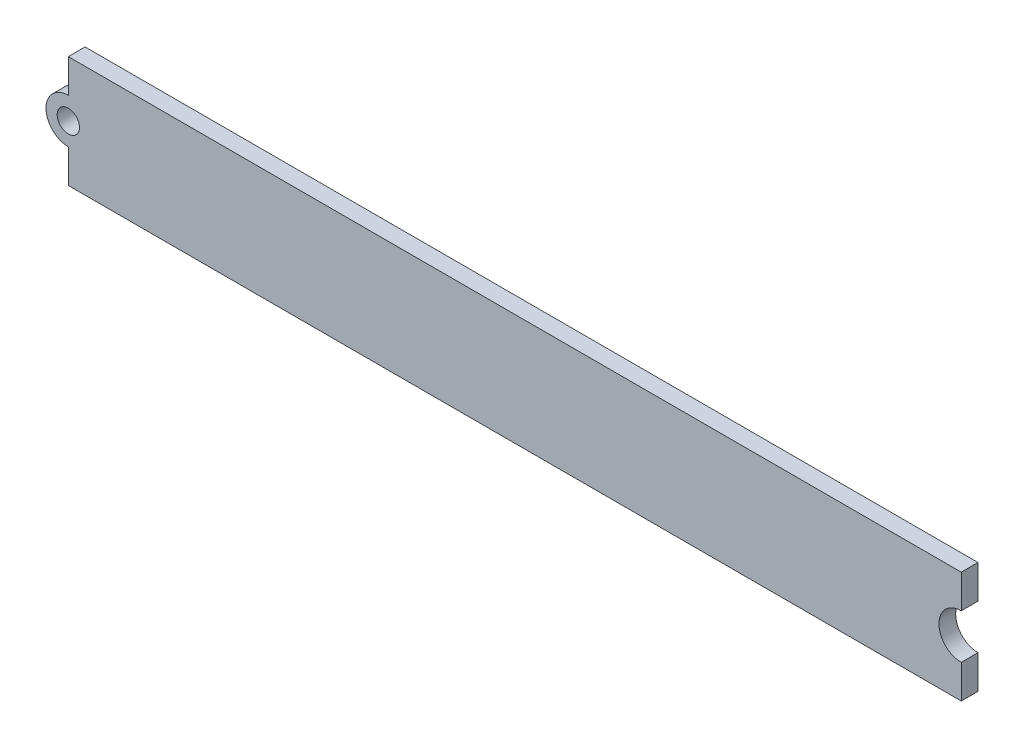
ISO-10303-21;
HEADER;
FILE_DESCRIPTION(('STEP AP214'),'2;1');
FILE_NAME('part.step','',(''),(''),'','','');
FILE_SCHEMA(('AUTOMOTIVE_DESIGN { 1 0 10303 214 1 1 1 1 }'));
ENDSEC;
DATA;
#1=APPLICATION_CONTEXT('core data for automotive mechanical design processes');
#2=APPLICATION_PROTOCOL_DEFINITION('international standard','automotive_design',2000,#1);
#3=PRODUCT_CONTEXT('',#1,'mechanical');
#4=PRODUCT('Part','Part','',(#3));
#5=PRODUCT_RELATED_PRODUCT_CATEGORY('part','',(#4));
#6=PRODUCT_DEFINITION_FORMATION('','',#4);
#7=PRODUCT_DEFINITION_CONTEXT('part definition',#1,'design');
#8=PRODUCT_DEFINITION('design','',#6,#7);
#9=PRODUCT_DEFINITION_SHAPE('','',#8);
#10=(LENGTH_UNIT() NAMED_UNIT(*) SI_UNIT(.MILLI.,.METRE.));
#11=(NAMED_UNIT(*) PLANE_ANGLE_UNIT() SI_UNIT($,.RADIAN.));
#12=(NAMED_UNIT(*) SI_UNIT($,.STERADIAN.) SOLID_ANGLE_UNIT());
#13=UNCERTAINTY_MEASURE_WITH_UNIT(LENGTH_MEASURE(1.E-05),#10,'distance_accuracy_value','');
#14=(GEOMETRIC_REPRESENTATION_CONTEXT(3) GLOBAL_UNCERTAINTY_ASSIGNED_CONTEXT((#13)) GLOBAL_UNIT_ASSIGNED_CONTEXT((#10,
#11,#12)) REPRESENTATION_CONTEXT('',''));
#15=CARTESIAN_POINT('',(0.,0.,0.));
#16=DIRECTION('',(0.,0.,1.));
#17=DIRECTION('',(1.,0.,0.));
#18=AXIS2_PLACEMENT_3D('',#15,#16,#17);
#19=CARTESIAN_POINT('',(-40.,0.,1.5));
#20=DIRECTION('',(0.,0.,1.));
#21=DIRECTION('',(1.,0.,0.));
#22=AXIS2_PLACEMENT_3D('',#19,#20,#21);
#23=PLANE('',#22);
#24=DIRECTION('',(0.,-1.,0.));
#25=VECTOR('',#24,1.);
#26=CARTESIAN_POINT('',(-40.,5.,1.5));
#27=LINE('',#26,#25);
#28=CARTESIAN_POINT('',(-40.,5.,1.5));
#29=VERTEX_POINT('',#28);
#30=CARTESIAN_POINT('',(-40.,2.,1.5));
#31=VERTEX_POINT('',#30);
#32=EDGE_CURVE('E151',#29,#31,#27,.T.);
#33=ORIENTED_EDGE('',*,*,#32,.T.);
#34=CARTESIAN_POINT('',(-40.,0.,1.5));
#35=DIRECTION('',(0.,0.,1.));
#36=DIRECTION('',(1.,0.,0.));
#37=AXIS2_PLACEMENT_3D('',#34,#35,#36);
#38=CIRCLE('',#37,2.);
#39=CARTESIAN_POINT('',(-40.,-2.,1.5));
#40=VERTEX_POINT('',#39);
#41=EDGE_CURVE('E99',#31,#40,#38,.T.);
#42=ORIENTED_EDGE('',*,*,#41,.T.);
#43=DIRECTION('',(0.,-1.,0.));
#44=VECTOR('',#43,1.);
#45=CARTESIAN_POINT('',(-40.,-2.,1.5));
#46=LINE('',#45,#44);
#47=CARTESIAN_POINT('',(-40.,-5.,1.5));
#48=VERTEX_POINT('',#47);
#49=EDGE_CURVE('E166',#40,#48,#46,.T.);
#50=ORIENTED_EDGE('',*,*,#49,.T.);
#51=DIRECTION('',(1.,0.,0.));
#52=VECTOR('',#51,1.);
#53=CARTESIAN_POINT('',(-40.,-5.,1.5));
#54=LINE('',#53,#52);
#55=CARTESIAN_POINT('',(40.,-4.99999999999999,1.5));
#56=VERTEX_POINT('',#55);
#57=EDGE_CURVE('E179',#48,#56,#54,.T.);
#58=ORIENTED_EDGE('',*,*,#57,.T.);
#59=DIRECTION('',(0.,1.,0.));
#60=VECTOR('',#59,1.);
#61=CARTESIAN_POINT('',(40.,-1.99999999999999,1.5));
#62=LINE('',#61,#60);
#63=CARTESIAN_POINT('',(40.,-1.99999999999999,1.5));
#64=VERTEX_POINT('',#63);
#65=EDGE_CURVE('E118',#56,#64,#62,.T.);
#66=ORIENTED_EDGE('',*,*,#65,.T.);
#67=CARTESIAN_POINT('',(40.,0.,1.5));
#68=DIRECTION('',(0.,0.,-1.));
#69=DIRECTION('',(1.,0.,0.));
#70=AXIS2_PLACEMENT_3D('',#67,#68,#69);
#71=CIRCLE('',#70,2.);
#72=CARTESIAN_POINT('',(40.,2.00000000000001,1.5));
#73=VERTEX_POINT('',#72);
#74=EDGE_CURVE('E112',#64,#73,#71,.T.);
#75=ORIENTED_EDGE('',*,*,#74,.T.);
#76=DIRECTION('',(0.,1.,0.));
#77=VECTOR('',#76,1.);
#78=CARTESIAN_POINT('',(40.,5.00000000000001,1.5));
#79=LINE('',#78,#77);
#80=CARTESIAN_POINT('',(40.,5.00000000000001,1.5));
#81=VERTEX_POINT('',#80);
#82=EDGE_CURVE('E116',#73,#81,#79,.T.);
#83=ORIENTED_EDGE('',*,*,#82,.T.);
#84=DIRECTION('',(-1.,0.,0.));
#85=VECTOR('',#84,1.);
#86=CARTESIAN_POINT('',(-40.,5.,1.5));
#87=LINE('',#86,#85);
#88=EDGE_CURVE('E56',#81,#29,#87,.T.);
#89=ORIENTED_EDGE('',*,*,#88,.T.);
#90=EDGE_LOOP('',(#33,#42,#50,#58,#66,#75,#83,#89));
#91=FACE_BOUND('',#90,.T.);
#92=CARTESIAN_POINT('',(-40.,0.,1.5));
#93=DIRECTION('',(0.,0.,1.));
#94=DIRECTION('',(1.,0.,0.));
#95=AXIS2_PLACEMENT_3D('',#92,#93,#94);
#96=CIRCLE('',#95,0.999999999999998);
#97=CARTESIAN_POINT('',(-39.,0.,1.5));
#98=VERTEX_POINT('',#97);
#99=EDGE_CURVE('E140',#98,#98,#96,.T.);
#100=ORIENTED_EDGE('',*,*,#99,.F.);
#101=EDGE_LOOP('',(#100));
#102=FACE_BOUND('',#101,.T.);
#103=ADVANCED_FACE('F39',(#91,#102),#23,.T.);
#104=CARTESIAN_POINT('',(-40.,0.,0.));
#105=DIRECTION('',(0.,0.,1.));
#106=DIRECTION('',(1.,0.,0.));
#107=AXIS2_PLACEMENT_3D('',#104,#105,#106);
#108=PLANE('',#107);
#109=DIRECTION('',(0.,-1.,0.));
#110=VECTOR('',#109,1.);
#111=CARTESIAN_POINT('',(-40.,5.,0.));
#112=LINE('',#111,#110);
#113=CARTESIAN_POINT('',(-40.,5.,0.));
#114=VERTEX_POINT('',#113);
#115=CARTESIAN_POINT('',(-40.,2.,0.));
#116=VERTEX_POINT('',#115);
#117=EDGE_CURVE('E136',#114,#116,#112,.T.);
#118=ORIENTED_EDGE('',*,*,#117,.F.);
#119=DIRECTION('',(-1.,0.,0.));
#120=VECTOR('',#119,1.);
#121=CARTESIAN_POINT('',(-40.,5.,0.));
#122=LINE('',#121,#120);
#123=CARTESIAN_POINT('',(40.,5.00000000000001,0.));
#124=VERTEX_POINT('',#123);
#125=EDGE_CURVE('E91',#124,#114,#122,.T.);
#126=ORIENTED_EDGE('',*,*,#125,.F.);
#127=DIRECTION('',(0.,1.,0.));
#128=VECTOR('',#127,1.);
#129=CARTESIAN_POINT('',(40.,5.00000000000001,0.));
#130=LINE('',#129,#128);
#131=CARTESIAN_POINT('',(40.,2.00000000000001,0.));
#132=VERTEX_POINT('',#131);
#133=EDGE_CURVE('E85',#132,#124,#130,.T.);
#134=ORIENTED_EDGE('',*,*,#133,.F.);
#135=CARTESIAN_POINT('',(40.,0.,0.));
#136=DIRECTION('',(0.,0.,-1.));
#137=DIRECTION('',(1.,0.,0.));
#138=AXIS2_PLACEMENT_3D('',#135,#136,#137);
#139=CIRCLE('',#138,2.);
#140=CARTESIAN_POINT('',(40.,-1.99999999999999,0.));
#141=VERTEX_POINT('',#140);
#142=EDGE_CURVE('E126',#141,#132,#139,.T.);
#143=ORIENTED_EDGE('',*,*,#142,.F.);
#144=DIRECTION('',(0.,1.,0.));
#145=VECTOR('',#144,1.);
#146=CARTESIAN_POINT('',(40.,-1.99999999999999,0.));
#147=LINE('',#146,#145);
#148=CARTESIAN_POINT('',(40.,-4.99999999999999,0.));
#149=VERTEX_POINT('',#148);
#150=EDGE_CURVE('E146',#149,#141,#147,.T.);
#151=ORIENTED_EDGE('',*,*,#150,.F.);
#152=DIRECTION('',(1.,0.,0.));
#153=VECTOR('',#152,1.);
#154=CARTESIAN_POINT('',(-40.,-5.,0.));
#155=LINE('',#154,#153);
#156=CARTESIAN_POINT('',(-40.,-5.,0.));
#157=VERTEX_POINT('',#156);
#158=EDGE_CURVE('E144',#157,#149,#155,.T.);
#159=ORIENTED_EDGE('',*,*,#158,.F.);
#160=DIRECTION('',(0.,-1.,0.));
#161=VECTOR('',#160,1.);
#162=CARTESIAN_POINT('',(-40.,-2.,0.));
#163=LINE('',#162,#161);
#164=CARTESIAN_POINT('',(-40.,-2.,0.));
#165=VERTEX_POINT('',#164);
#166=EDGE_CURVE('E142',#165,#157,#163,.T.);
#167=ORIENTED_EDGE('',*,*,#166,.F.);
#168=CARTESIAN_POINT('',(-40.,0.,0.));
#169=DIRECTION('',(0.,0.,1.));
#170=DIRECTION('',(1.,0.,0.));
#171=AXIS2_PLACEMENT_3D('',#168,#169,#170);
#172=CIRCLE('',#171,2.);
#173=EDGE_CURVE('E139',#116,#165,#172,.T.);
#174=ORIENTED_EDGE('',*,*,#173,.F.);
#175=EDGE_LOOP('',(#118,#126,#134,#143,#151,#159,#167,#174));
#176=FACE_BOUND('',#175,.T.);
#177=CARTESIAN_POINT('',(-40.,0.,0.));
#178=DIRECTION('',(0.,0.,1.));
#179=DIRECTION('',(1.,0.,0.));
#180=AXIS2_PLACEMENT_3D('',#177,#178,#179);
#181=CIRCLE('',#180,0.999999999999998);
#182=CARTESIAN_POINT('',(-39.,0.,0.));
#183=VERTEX_POINT('',#182);
#184=EDGE_CURVE('E185',#183,#183,#181,.T.);
#185=ORIENTED_EDGE('',*,*,#184,.T.);
#186=EDGE_LOOP('',(#185));
#187=FACE_BOUND('',#186,.T.);
#188=ADVANCED_FACE('F170',(#176,#187),#108,.F.);
#189=CARTESIAN_POINT('',(-40.,5.,1.5));
#190=DIRECTION('',(1.,0.,0.));
#191=DIRECTION('',(0.,0.,-1.));
#192=AXIS2_PLACEMENT_3D('',#189,#190,#191);
#193=PLANE('',#192);
#194=ORIENTED_EDGE('',*,*,#117,.T.);
#195=DIRECTION('',(0.,0.,-1.));
#196=VECTOR('',#195,1.);
#197=CARTESIAN_POINT('',(-40.,2.,1.5));
#198=LINE('',#197,#196);
#199=EDGE_CURVE('E11',#31,#116,#198,.T.);
#200=ORIENTED_EDGE('',*,*,#199,.F.);
#201=ORIENTED_EDGE('',*,*,#32,.F.);
#202=DIRECTION('',(0.,0.,-1.));
#203=VECTOR('',#202,1.);
#204=CARTESIAN_POINT('',(-40.,5.,1.5));
#205=LINE('',#204,#203);
#206=EDGE_CURVE('E132',#29,#114,#205,.T.);
#207=ORIENTED_EDGE('',*,*,#206,.T.);
#208=EDGE_LOOP('',(#194,#200,#201,#207));
#209=FACE_BOUND('',#208,.T.);
#210=ADVANCED_FACE('F41',(#209),#193,.F.);
#211=CARTESIAN_POINT('',(-40.,0.,1.5));
#212=DIRECTION('',(0.,0.,-1.));
#213=DIRECTION('',(-1.,0.,0.));
#214=AXIS2_PLACEMENT_3D('',#211,#212,#213);
#215=CYLINDRICAL_SURFACE('',#214,2.);
#216=ORIENTED_EDGE('',*,*,#173,.T.);
#217=DIRECTION('',(0.,0.,-1.));
#218=VECTOR('',#217,1.);
#219=CARTESIAN_POINT('',(-40.,-2.,1.5));
#220=LINE('',#219,#218);
#221=EDGE_CURVE('E48',#40,#165,#220,.T.);
#222=ORIENTED_EDGE('',*,*,#221,.F.);
#223=ORIENTED_EDGE('',*,*,#41,.F.);
#224=ORIENTED_EDGE('',*,*,#199,.T.);
#225=EDGE_LOOP('',(#216,#222,#223,#224));
#226=FACE_BOUND('',#225,.T.);
#227=ADVANCED_FACE('F212',(#226),#215,.T.);
#228=CARTESIAN_POINT('',(-40.,-2.,1.5));
#229=DIRECTION('',(1.,0.,0.));
#230=DIRECTION('',(0.,0.,-1.));
#231=AXIS2_PLACEMENT_3D('',#228,#229,#230);
#232=PLANE('',#231);
#233=ORIENTED_EDGE('',*,*,#166,.T.);
#234=DIRECTION('',(0.,0.,-1.));
#235=VECTOR('',#234,1.);
#236=CARTESIAN_POINT('',(-40.,-5.,1.5));
#237=LINE('',#236,#235);
#238=EDGE_CURVE('E158',#48,#157,#237,.T.);
#239=ORIENTED_EDGE('',*,*,#238,.F.);
#240=ORIENTED_EDGE('',*,*,#49,.F.);
#241=ORIENTED_EDGE('',*,*,#221,.T.);
#242=EDGE_LOOP('',(#233,#239,#240,#241));
#243=FACE_BOUND('',#242,.T.);
#244=ADVANCED_FACE('F164',(#243),#232,.F.);
#245=CARTESIAN_POINT('',(-40.,-5.,1.5));
#246=DIRECTION('',(0.,1.,0.));
#247=DIRECTION('',(-1.,0.,0.));
#248=AXIS2_PLACEMENT_3D('',#245,#246,#247);
#249=PLANE('',#248);
#250=ORIENTED_EDGE('',*,*,#158,.T.);
#251=DIRECTION('',(0.,0.,-1.));
#252=VECTOR('',#251,1.);
#253=CARTESIAN_POINT('',(40.,-4.99999999999999,1.5));
#254=LINE('',#253,#252);
#255=EDGE_CURVE('E155',#56,#149,#254,.T.);
#256=ORIENTED_EDGE('',*,*,#255,.F.);
#257=ORIENTED_EDGE('',*,*,#57,.F.);
#258=ORIENTED_EDGE('',*,*,#238,.T.);
#259=EDGE_LOOP('',(#250,#256,#257,#258));
#260=FACE_BOUND('',#259,.T.);
#261=ADVANCED_FACE('F175',(#260),#249,.F.);
#262=CARTESIAN_POINT('',(40.,-1.99999999999999,1.5));
#263=DIRECTION('',(-1.,0.,0.));
#264=DIRECTION('',(0.,0.,1.));
#265=AXIS2_PLACEMENT_3D('',#262,#263,#264);
#266=PLANE('',#265);
#267=ORIENTED_EDGE('',*,*,#150,.T.);
#268=DIRECTION('',(0.,0.,-1.));
#269=VECTOR('',#268,1.);
#270=CARTESIAN_POINT('',(40.,-1.99999999999999,1.5));
#271=LINE('',#270,#269);
#272=EDGE_CURVE('E127',#64,#141,#271,.T.);
#273=ORIENTED_EDGE('',*,*,#272,.F.);
#274=ORIENTED_EDGE('',*,*,#65,.F.);
#275=ORIENTED_EDGE('',*,*,#255,.T.);
#276=EDGE_LOOP('',(#267,#273,#274,#275));
#277=FACE_BOUND('',#276,.T.);
#278=ADVANCED_FACE('F178',(#277),#266,.F.);
#279=CARTESIAN_POINT('',(40.,0.,1.5));
#280=DIRECTION('',(0.,0.,-1.));
#281=DIRECTION('',(-1.,0.,0.));
#282=AXIS2_PLACEMENT_3D('',#279,#280,#281);
#283=CYLINDRICAL_SURFACE('',#282,2.);
#284=ORIENTED_EDGE('',*,*,#142,.T.);
#285=DIRECTION('',(0.,0.,-1.));
#286=VECTOR('',#285,1.);
#287=CARTESIAN_POINT('',(40.,2.00000000000001,1.5));
#288=LINE('',#287,#286);
#289=EDGE_CURVE('E123',#73,#132,#288,.T.);
#290=ORIENTED_EDGE('',*,*,#289,.F.);
#291=ORIENTED_EDGE('',*,*,#74,.F.);
#292=ORIENTED_EDGE('',*,*,#272,.T.);
#293=EDGE_LOOP('',(#284,#290,#291,#292));
#294=FACE_BOUND('',#293,.T.);
#295=ADVANCED_FACE('F124',(#294),#283,.F.);
#296=CARTESIAN_POINT('',(40.,5.00000000000001,1.5));
#297=DIRECTION('',(-1.,0.,0.));
#298=DIRECTION('',(0.,0.,1.));
#299=AXIS2_PLACEMENT_3D('',#296,#297,#298);
#300=PLANE('',#299);
#301=ORIENTED_EDGE('',*,*,#133,.T.);
#302=DIRECTION('',(0.,0.,-1.));
#303=VECTOR('',#302,1.);
#304=CARTESIAN_POINT('',(40.,5.00000000000001,1.5));
#305=LINE('',#304,#303);
#306=EDGE_CURVE('E128',#81,#124,#305,.T.);
#307=ORIENTED_EDGE('',*,*,#306,.F.);
#308=ORIENTED_EDGE('',*,*,#82,.F.);
#309=ORIENTED_EDGE('',*,*,#289,.T.);
#310=EDGE_LOOP('',(#301,#307,#308,#309));
#311=FACE_BOUND('',#310,.T.);
#312=ADVANCED_FACE('F130',(#311),#300,.F.);
#313=CARTESIAN_POINT('',(-40.,5.,1.5));
#314=DIRECTION('',(0.,-1.,0.));
#315=DIRECTION('',(1.,0.,0.));
#316=AXIS2_PLACEMENT_3D('',#313,#314,#315);
#317=PLANE('',#316);
#318=ORIENTED_EDGE('',*,*,#125,.T.);
#319=ORIENTED_EDGE('',*,*,#206,.F.);
#320=ORIENTED_EDGE('',*,*,#88,.F.);
#321=ORIENTED_EDGE('',*,*,#306,.T.);
#322=EDGE_LOOP('',(#318,#319,#320,#321));
#323=FACE_BOUND('',#322,.T.);
#324=ADVANCED_FACE('F200',(#323),#317,.F.);
#325=CARTESIAN_POINT('',(-40.,0.,1.5));
#326=DIRECTION('',(0.,0.,-1.));
#327=DIRECTION('',(-1.,0.,0.));
#328=AXIS2_PLACEMENT_3D('',#325,#326,#327);
#329=CYLINDRICAL_SURFACE('',#328,0.999999999999998);
#330=ORIENTED_EDGE('',*,*,#99,.T.);
#331=EDGE_LOOP('',(#330));
#332=FACE_BOUND('',#331,.T.);
#333=ORIENTED_EDGE('',*,*,#184,.F.);
#334=EDGE_LOOP('',(#333));
#335=FACE_BOUND('',#334,.T.);
#336=ADVANCED_FACE('F191',(#332,#335),#329,.F.);
#337=CLOSED_SHELL('',(#103,#188,#210,#227,#244,#261,#278,#295,#312,#324,#336));
#338=MANIFOLD_SOLID_BREP('B2',#337);
#339=ADVANCED_BREP_SHAPE_REPRESENTATION('',(#18,#338),#14);
#340=SHAPE_DEFINITION_REPRESENTATION(#9,#339);
ENDSEC;
END-ISO-10303-21;
